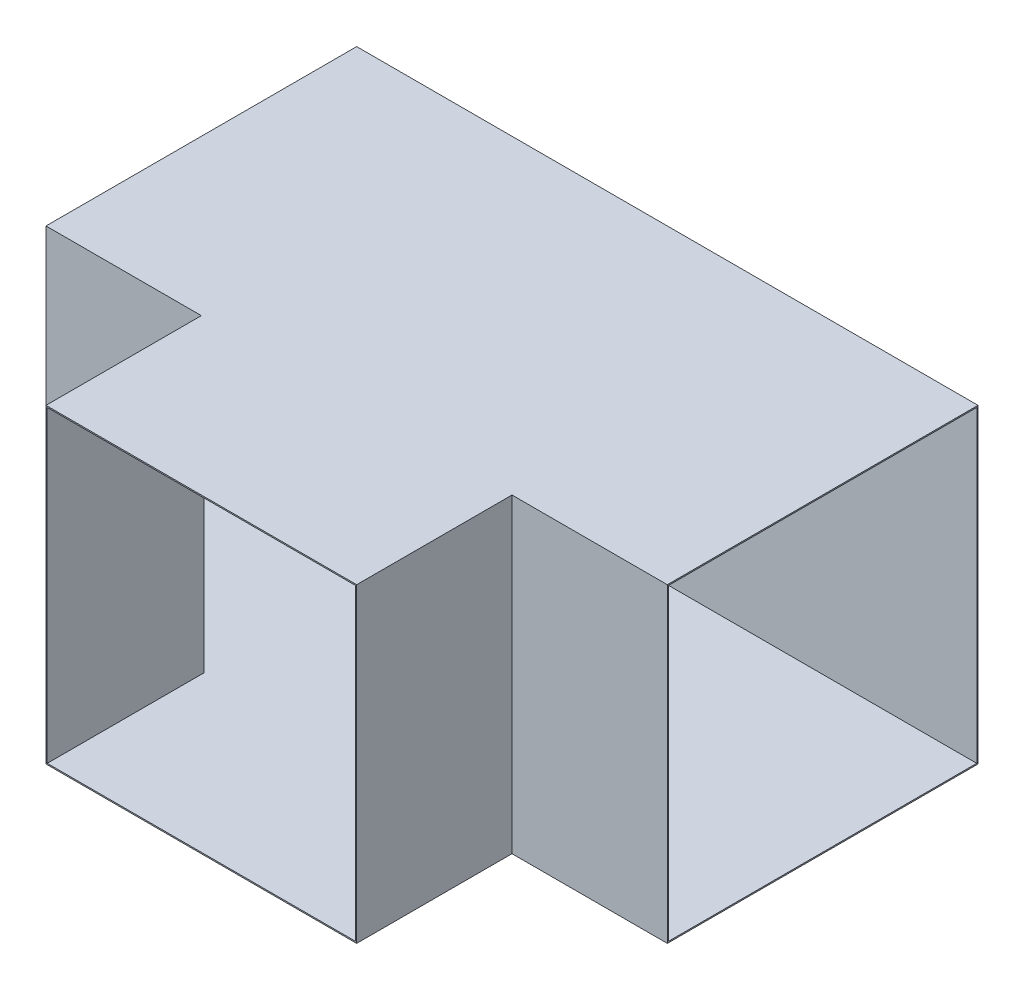
ISO-10303-21;
HEADER;
FILE_DESCRIPTION(('STEP AP214'),'2;1');
FILE_NAME('part.step','',(''),(''),'','','');
FILE_SCHEMA(('AUTOMOTIVE_DESIGN { 1 0 10303 214 1 1 1 1 }'));
ENDSEC;
DATA;
#1=APPLICATION_CONTEXT('core data for automotive mechanical design processes');
#2=APPLICATION_PROTOCOL_DEFINITION('international standard','automotive_design',2000,#1);
#3=PRODUCT_CONTEXT('',#1,'mechanical');
#4=PRODUCT('Part','Part','',(#3));
#5=PRODUCT_RELATED_PRODUCT_CATEGORY('part','',(#4));
#6=PRODUCT_DEFINITION_FORMATION('','',#4);
#7=PRODUCT_DEFINITION_CONTEXT('part definition',#1,'design');
#8=PRODUCT_DEFINITION('design','',#6,#7);
#9=PRODUCT_DEFINITION_SHAPE('','',#8);
#10=(LENGTH_UNIT() NAMED_UNIT(*) SI_UNIT(.MILLI.,.METRE.));
#11=(NAMED_UNIT(*) PLANE_ANGLE_UNIT() SI_UNIT($,.RADIAN.));
#12=(NAMED_UNIT(*) SI_UNIT($,.STERADIAN.) SOLID_ANGLE_UNIT());
#13=UNCERTAINTY_MEASURE_WITH_UNIT(LENGTH_MEASURE(1.E-05),#10,'distance_accuracy_value','');
#14=(GEOMETRIC_REPRESENTATION_CONTEXT(3) GLOBAL_UNCERTAINTY_ASSIGNED_CONTEXT((#13)) GLOBAL_UNIT_ASSIGNED_CONTEXT((#10,
#11,#12)) REPRESENTATION_CONTEXT('',''));
#15=CARTESIAN_POINT('',(0.,0.,0.));
#16=DIRECTION('',(0.,0.,1.));
#17=DIRECTION('',(1.,0.,0.));
#18=AXIS2_PLACEMENT_3D('',#15,#16,#17);
#19=CARTESIAN_POINT('',(500.,250.,248.));
#20=DIRECTION('',(0.,0.,-1.));
#21=DIRECTION('',(0.,1.,0.));
#22=AXIS2_PLACEMENT_3D('',#19,#20,#21);
#23=PLANE('',#22);
#24=DIRECTION('',(-1.,0.,0.));
#25=VECTOR('',#24,1.);
#26=CARTESIAN_POINT('',(500.,-248.,248.));
#27=LINE('',#26,#25);
#28=CARTESIAN_POINT('',(500.,-248.,248.));
#29=VERTEX_POINT('',#28);
#30=CARTESIAN_POINT('',(248.,-248.,248.));
#31=VERTEX_POINT('',#30);
#32=EDGE_CURVE('E221',#29,#31,#27,.T.);
#33=ORIENTED_EDGE('',*,*,#32,.T.);
#34=DIRECTION('',(0.,-1.,0.));
#35=VECTOR('',#34,1.);
#36=CARTESIAN_POINT('',(248.,248.,248.));
#37=LINE('',#36,#35);
#38=CARTESIAN_POINT('',(248.,248.,248.));
#39=VERTEX_POINT('',#38);
#40=EDGE_CURVE('E215',#39,#31,#37,.T.);
#41=ORIENTED_EDGE('',*,*,#40,.F.);
#42=DIRECTION('',(-1.,0.,0.));
#43=VECTOR('',#42,1.);
#44=CARTESIAN_POINT('',(500.,248.,248.));
#45=LINE('',#44,#43);
#46=CARTESIAN_POINT('',(500.,248.,248.));
#47=VERTEX_POINT('',#46);
#48=EDGE_CURVE('E511',#47,#39,#45,.T.);
#49=ORIENTED_EDGE('',*,*,#48,.F.);
#50=DIRECTION('',(0.,-1.,0.));
#51=VECTOR('',#50,1.);
#52=CARTESIAN_POINT('',(500.,250.,248.));
#53=LINE('',#52,#51);
#54=EDGE_CURVE('E523',#47,#29,#53,.T.);
#55=ORIENTED_EDGE('',*,*,#54,.T.);
#56=EDGE_LOOP('',(#33,#41,#49,#55));
#57=FACE_BOUND('',#56,.T.);
#58=ADVANCED_FACE('F80',(#57),#23,.T.);
#59=CARTESIAN_POINT('',(-248.,248.,248.));
#60=VERTEX_POINT('',#59);
#61=CARTESIAN_POINT('',(-500.,248.,248.));
#62=VERTEX_POINT('',#61);
#63=EDGE_CURVE('E214',#60,#62,#45,.T.);
#64=ORIENTED_EDGE('',*,*,#63,.F.);
#65=DIRECTION('',(0.,1.,0.));
#66=VECTOR('',#65,1.);
#67=CARTESIAN_POINT('',(-248.,-248.,248.));
#68=LINE('',#67,#66);
#69=CARTESIAN_POINT('',(-248.,-248.,248.));
#70=VERTEX_POINT('',#69);
#71=EDGE_CURVE('E198',#70,#60,#68,.T.);
#72=ORIENTED_EDGE('',*,*,#71,.F.);
#73=CARTESIAN_POINT('',(-500.,-248.,248.));
#74=VERTEX_POINT('',#73);
#75=EDGE_CURVE('E212',#70,#74,#27,.T.);
#76=ORIENTED_EDGE('',*,*,#75,.T.);
#77=DIRECTION('',(0.,-1.,0.));
#78=VECTOR('',#77,1.);
#79=CARTESIAN_POINT('',(-500.,250.,248.));
#80=LINE('',#79,#78);
#81=EDGE_CURVE('E321',#62,#74,#80,.T.);
#82=ORIENTED_EDGE('',*,*,#81,.F.);
#83=EDGE_LOOP('',(#64,#72,#76,#82));
#84=FACE_BOUND('',#83,.T.);
#85=ADVANCED_FACE('F210',(#84),#23,.T.);
#86=CARTESIAN_POINT('',(500.,250.,250.));
#87=DIRECTION('',(0.,0.,-1.));
#88=DIRECTION('',(0.,1.,0.));
#89=AXIS2_PLACEMENT_3D('',#86,#87,#88);
#90=PLANE('',#89);
#91=DIRECTION('',(-1.,0.,0.));
#92=VECTOR('',#91,1.);
#93=CARTESIAN_POINT('',(500.,-250.,250.));
#94=LINE('',#93,#92);
#95=CARTESIAN_POINT('',(-250.,-250.,250.));
#96=VERTEX_POINT('',#95);
#97=CARTESIAN_POINT('',(-500.,-250.,250.));
#98=VERTEX_POINT('',#97);
#99=EDGE_CURVE('E89',#96,#98,#94,.T.);
#100=ORIENTED_EDGE('',*,*,#99,.F.);
#101=DIRECTION('',(0.,1.,0.));
#102=VECTOR('',#101,1.);
#103=CARTESIAN_POINT('',(-250.,-250.,250.));
#104=LINE('',#103,#102);
#105=CARTESIAN_POINT('',(-250.,250.,250.));
#106=VERTEX_POINT('',#105);
#107=EDGE_CURVE('E206',#96,#106,#104,.T.);
#108=ORIENTED_EDGE('',*,*,#107,.T.);
#109=DIRECTION('',(-1.,0.,0.));
#110=VECTOR('',#109,1.);
#111=CARTESIAN_POINT('',(500.,250.,250.));
#112=LINE('',#111,#110);
#113=CARTESIAN_POINT('',(-500.,250.,250.));
#114=VERTEX_POINT('',#113);
#115=EDGE_CURVE('E240',#106,#114,#112,.T.);
#116=ORIENTED_EDGE('',*,*,#115,.T.);
#117=DIRECTION('',(0.,-1.,0.));
#118=VECTOR('',#117,1.);
#119=CARTESIAN_POINT('',(-500.,250.,250.));
#120=LINE('',#119,#118);
#121=EDGE_CURVE('E225',#114,#98,#120,.T.);
#122=ORIENTED_EDGE('',*,*,#121,.T.);
#123=EDGE_LOOP('',(#100,#108,#116,#122));
#124=FACE_BOUND('',#123,.T.);
#125=ADVANCED_FACE('F284',(#124),#90,.F.);
#126=CARTESIAN_POINT('',(500.,0.,0.));
#127=DIRECTION('',(1.,0.,0.));
#128=DIRECTION('',(0.,0.,-1.));
#129=AXIS2_PLACEMENT_3D('',#126,#127,#128);
#130=PLANE('',#129);
#131=DIRECTION('',(0.,-1.,0.));
#132=VECTOR('',#131,1.);
#133=CARTESIAN_POINT('',(500.,250.,250.));
#134=LINE('',#133,#132);
#135=CARTESIAN_POINT('',(500.,250.,250.));
#136=VERTEX_POINT('',#135);
#137=CARTESIAN_POINT('',(500.,-250.,250.));
#138=VERTEX_POINT('',#137);
#139=EDGE_CURVE('E230',#136,#138,#134,.T.);
#140=ORIENTED_EDGE('',*,*,#139,.T.);
#141=DIRECTION('',(0.,0.,-1.));
#142=VECTOR('',#141,1.);
#143=CARTESIAN_POINT('',(500.,-250.,250.));
#144=LINE('',#143,#142);
#145=CARTESIAN_POINT('',(500.,-250.,-250.));
#146=VERTEX_POINT('',#145);
#147=EDGE_CURVE('E233',#138,#146,#144,.T.);
#148=ORIENTED_EDGE('',*,*,#147,.T.);
#149=DIRECTION('',(0.,1.,0.));
#150=VECTOR('',#149,1.);
#151=CARTESIAN_POINT('',(500.,250.,-250.));
#152=LINE('',#151,#150);
#153=CARTESIAN_POINT('',(500.,250.,-250.));
#154=VERTEX_POINT('',#153);
#155=EDGE_CURVE('E236',#146,#154,#152,.T.);
#156=ORIENTED_EDGE('',*,*,#155,.T.);
#157=DIRECTION('',(0.,0.,1.));
#158=VECTOR('',#157,1.);
#159=CARTESIAN_POINT('',(500.,250.,250.));
#160=LINE('',#159,#158);
#161=EDGE_CURVE('E238',#154,#136,#160,.T.);
#162=ORIENTED_EDGE('',*,*,#161,.T.);
#163=EDGE_LOOP('',(#140,#148,#156,#162));
#164=FACE_BOUND('',#163,.T.);
#165=DIRECTION('',(0.,0.,-1.));
#166=VECTOR('',#165,1.);
#167=CARTESIAN_POINT('',(500.,-248.,250.));
#168=LINE('',#167,#166);
#169=CARTESIAN_POINT('',(500.,-248.,-248.));
#170=VERTEX_POINT('',#169);
#171=EDGE_CURVE('E532',#29,#170,#168,.T.);
#172=ORIENTED_EDGE('',*,*,#171,.F.);
#173=ORIENTED_EDGE('',*,*,#54,.F.);
#174=DIRECTION('',(0.,0.,1.));
#175=VECTOR('',#174,1.);
#176=CARTESIAN_POINT('',(500.,248.,250.));
#177=LINE('',#176,#175);
#178=CARTESIAN_POINT('',(500.,248.,-248.));
#179=VERTEX_POINT('',#178);
#180=EDGE_CURVE('E517',#179,#47,#177,.T.);
#181=ORIENTED_EDGE('',*,*,#180,.F.);
#182=DIRECTION('',(0.,1.,0.));
#183=VECTOR('',#182,1.);
#184=CARTESIAN_POINT('',(500.,250.,-248.));
#185=LINE('',#184,#183);
#186=EDGE_CURVE('E529',#170,#179,#185,.T.);
#187=ORIENTED_EDGE('',*,*,#186,.F.);
#188=EDGE_LOOP('',(#172,#173,#181,#187));
#189=FACE_BOUND('',#188,.T.);
#190=ADVANCED_FACE('F335',(#164,#189),#130,.T.);
#191=CARTESIAN_POINT('',(-500.,0.,0.));
#192=DIRECTION('',(1.,0.,0.));
#193=DIRECTION('',(0.,0.,-1.));
#194=AXIS2_PLACEMENT_3D('',#191,#192,#193);
#195=PLANE('',#194);
#196=ORIENTED_EDGE('',*,*,#121,.F.);
#197=DIRECTION('',(0.,0.,1.));
#198=VECTOR('',#197,1.);
#199=CARTESIAN_POINT('',(-500.,250.,250.));
#200=LINE('',#199,#198);
#201=CARTESIAN_POINT('',(-500.,250.,-250.));
#202=VERTEX_POINT('',#201);
#203=EDGE_CURVE('E234',#202,#114,#200,.T.);
#204=ORIENTED_EDGE('',*,*,#203,.F.);
#205=DIRECTION('',(0.,1.,0.));
#206=VECTOR('',#205,1.);
#207=CARTESIAN_POINT('',(-500.,250.,-250.));
#208=LINE('',#207,#206);
#209=CARTESIAN_POINT('',(-500.,-250.,-250.));
#210=VERTEX_POINT('',#209);
#211=EDGE_CURVE('E245',#210,#202,#208,.T.);
#212=ORIENTED_EDGE('',*,*,#211,.F.);
#213=DIRECTION('',(0.,0.,-1.));
#214=VECTOR('',#213,1.);
#215=CARTESIAN_POINT('',(-500.,-250.,250.));
#216=LINE('',#215,#214);
#217=EDGE_CURVE('E243',#98,#210,#216,.T.);
#218=ORIENTED_EDGE('',*,*,#217,.F.);
#219=EDGE_LOOP('',(#196,#204,#212,#218));
#220=FACE_BOUND('',#219,.T.);
#221=ORIENTED_EDGE('',*,*,#81,.T.);
#222=DIRECTION('',(0.,0.,-1.));
#223=VECTOR('',#222,1.);
#224=CARTESIAN_POINT('',(-500.,-248.,250.));
#225=LINE('',#224,#223);
#226=CARTESIAN_POINT('',(-500.,-248.,-248.));
#227=VERTEX_POINT('',#226);
#228=EDGE_CURVE('E219',#74,#227,#225,.T.);
#229=ORIENTED_EDGE('',*,*,#228,.T.);
#230=DIRECTION('',(0.,1.,0.));
#231=VECTOR('',#230,1.);
#232=CARTESIAN_POINT('',(-500.,250.,-248.));
#233=LINE('',#232,#231);
#234=CARTESIAN_POINT('',(-500.,248.,-248.));
#235=VERTEX_POINT('',#234);
#236=EDGE_CURVE('E524',#227,#235,#233,.T.);
#237=ORIENTED_EDGE('',*,*,#236,.T.);
#238=DIRECTION('',(0.,0.,1.));
#239=VECTOR('',#238,1.);
#240=CARTESIAN_POINT('',(-500.,248.,250.));
#241=LINE('',#240,#239);
#242=EDGE_CURVE('E520',#235,#62,#241,.T.);
#243=ORIENTED_EDGE('',*,*,#242,.T.);
#244=EDGE_LOOP('',(#221,#229,#237,#243));
#245=FACE_BOUND('',#244,.T.);
#246=ADVANCED_FACE('F279',(#220,#245),#195,.F.);
#247=CARTESIAN_POINT('',(250.,250.,250.));
#248=VERTEX_POINT('',#247);
#249=EDGE_CURVE('E257',#136,#248,#112,.T.);
#250=ORIENTED_EDGE('',*,*,#249,.T.);
#251=DIRECTION('',(0.,-1.,0.));
#252=VECTOR('',#251,1.);
#253=CARTESIAN_POINT('',(250.,-250.,250.));
#254=LINE('',#253,#252);
#255=CARTESIAN_POINT('',(250.,-250.,250.));
#256=VERTEX_POINT('',#255);
#257=EDGE_CURVE('E307',#248,#256,#254,.T.);
#258=ORIENTED_EDGE('',*,*,#257,.T.);
#259=EDGE_CURVE('E12',#138,#256,#94,.T.);
#260=ORIENTED_EDGE('',*,*,#259,.F.);
#261=ORIENTED_EDGE('',*,*,#139,.F.);
#262=EDGE_LOOP('',(#250,#258,#260,#261));
#263=FACE_BOUND('',#262,.T.);
#264=ADVANCED_FACE('F82',(#263),#90,.F.);
#265=CARTESIAN_POINT('',(500.,-250.,250.));
#266=DIRECTION('',(0.,1.,0.));
#267=DIRECTION('',(0.,0.,1.));
#268=AXIS2_PLACEMENT_3D('',#265,#266,#267);
#269=PLANE('',#268);
#270=ORIENTED_EDGE('',*,*,#217,.T.);
#271=DIRECTION('',(-1.,0.,0.));
#272=VECTOR('',#271,1.);
#273=CARTESIAN_POINT('',(500.,-250.,-250.));
#274=LINE('',#273,#272);
#275=EDGE_CURVE('E261',#146,#210,#274,.T.);
#276=ORIENTED_EDGE('',*,*,#275,.F.);
#277=ORIENTED_EDGE('',*,*,#147,.F.);
#278=ORIENTED_EDGE('',*,*,#259,.T.);
#279=DIRECTION('',(0.,0.,-1.));
#280=VECTOR('',#279,1.);
#281=CARTESIAN_POINT('',(250.,-250.,500.));
#282=LINE('',#281,#280);
#283=CARTESIAN_POINT('',(250.,-250.,500.));
#284=VERTEX_POINT('',#283);
#285=EDGE_CURVE('E105',#284,#256,#282,.T.);
#286=ORIENTED_EDGE('',*,*,#285,.F.);
#287=DIRECTION('',(-1.,0.,0.));
#288=VECTOR('',#287,1.);
#289=CARTESIAN_POINT('',(-250.,-250.,500.));
#290=LINE('',#289,#288);
#291=CARTESIAN_POINT('',(-250.,-250.,500.));
#292=VERTEX_POINT('',#291);
#293=EDGE_CURVE('E294',#284,#292,#290,.T.);
#294=ORIENTED_EDGE('',*,*,#293,.T.);
#295=DIRECTION('',(0.,0.,-1.));
#296=VECTOR('',#295,1.);
#297=CARTESIAN_POINT('',(-250.,-250.,500.));
#298=LINE('',#297,#296);
#299=EDGE_CURVE('E306',#292,#96,#298,.T.);
#300=ORIENTED_EDGE('',*,*,#299,.T.);
#301=ORIENTED_EDGE('',*,*,#99,.T.);
#302=EDGE_LOOP('',(#270,#276,#277,#278,#286,#294,#300,#301));
#303=FACE_BOUND('',#302,.T.);
#304=ADVANCED_FACE('F339',(#303),#269,.F.);
#305=CARTESIAN_POINT('',(500.,250.,-250.));
#306=DIRECTION('',(0.,0.,1.));
#307=DIRECTION('',(0.,-1.,0.));
#308=AXIS2_PLACEMENT_3D('',#305,#306,#307);
#309=PLANE('',#308);
#310=ORIENTED_EDGE('',*,*,#211,.T.);
#311=DIRECTION('',(-1.,0.,0.));
#312=VECTOR('',#311,1.);
#313=CARTESIAN_POINT('',(500.,250.,-250.));
#314=LINE('',#313,#312);
#315=EDGE_CURVE('E251',#154,#202,#314,.T.);
#316=ORIENTED_EDGE('',*,*,#315,.F.);
#317=ORIENTED_EDGE('',*,*,#155,.F.);
#318=ORIENTED_EDGE('',*,*,#275,.T.);
#319=EDGE_LOOP('',(#310,#316,#317,#318));
#320=FACE_BOUND('',#319,.T.);
#321=ADVANCED_FACE('F337',(#320),#309,.F.);
#322=CARTESIAN_POINT('',(500.,250.,250.));
#323=DIRECTION('',(0.,-1.,0.));
#324=DIRECTION('',(0.,0.,-1.));
#325=AXIS2_PLACEMENT_3D('',#322,#323,#324);
#326=PLANE('',#325);
#327=ORIENTED_EDGE('',*,*,#203,.T.);
#328=ORIENTED_EDGE('',*,*,#115,.F.);
#329=DIRECTION('',(0.,0.,-1.));
#330=VECTOR('',#329,1.);
#331=CARTESIAN_POINT('',(-250.,250.,500.));
#332=LINE('',#331,#330);
#333=CARTESIAN_POINT('',(-250.,250.,500.));
#334=VERTEX_POINT('',#333);
#335=EDGE_CURVE('E288',#334,#106,#332,.T.);
#336=ORIENTED_EDGE('',*,*,#335,.F.);
#337=DIRECTION('',(1.,0.,0.));
#338=VECTOR('',#337,1.);
#339=CARTESIAN_POINT('',(-250.,250.,500.));
#340=LINE('',#339,#338);
#341=CARTESIAN_POINT('',(250.,250.,500.));
#342=VERTEX_POINT('',#341);
#343=EDGE_CURVE('E290',#334,#342,#340,.T.);
#344=ORIENTED_EDGE('',*,*,#343,.T.);
#345=DIRECTION('',(0.,0.,-1.));
#346=VECTOR('',#345,1.);
#347=CARTESIAN_POINT('',(250.,250.,500.));
#348=LINE('',#347,#346);
#349=EDGE_CURVE('E293',#342,#248,#348,.T.);
#350=ORIENTED_EDGE('',*,*,#349,.T.);
#351=ORIENTED_EDGE('',*,*,#249,.F.);
#352=ORIENTED_EDGE('',*,*,#161,.F.);
#353=ORIENTED_EDGE('',*,*,#315,.T.);
#354=EDGE_LOOP('',(#327,#328,#336,#344,#350,#351,#352,#353));
#355=FACE_BOUND('',#354,.T.);
#356=ADVANCED_FACE('F274',(#355),#326,.F.);
#357=CARTESIAN_POINT('',(500.,-248.,250.));
#358=DIRECTION('',(0.,1.,0.));
#359=DIRECTION('',(0.,0.,1.));
#360=AXIS2_PLACEMENT_3D('',#357,#358,#359);
#361=PLANE('',#360);
#362=ORIENTED_EDGE('',*,*,#228,.F.);
#363=ORIENTED_EDGE('',*,*,#75,.F.);
#364=DIRECTION('',(0.,0.,-1.));
#365=VECTOR('',#364,1.);
#366=CARTESIAN_POINT('',(-248.,-248.,500.));
#367=LINE('',#366,#365);
#368=CARTESIAN_POINT('',(-248.,-248.,500.));
#369=VERTEX_POINT('',#368);
#370=EDGE_CURVE('E195',#369,#70,#367,.T.);
#371=ORIENTED_EDGE('',*,*,#370,.F.);
#372=DIRECTION('',(-1.,0.,0.));
#373=VECTOR('',#372,1.);
#374=CARTESIAN_POINT('',(-250.,-248.,500.));
#375=LINE('',#374,#373);
#376=CARTESIAN_POINT('',(248.,-248.,500.));
#377=VERTEX_POINT('',#376);
#378=EDGE_CURVE('E537',#377,#369,#375,.T.);
#379=ORIENTED_EDGE('',*,*,#378,.F.);
#380=DIRECTION('',(0.,0.,-1.));
#381=VECTOR('',#380,1.);
#382=CARTESIAN_POINT('',(248.,-248.,500.));
#383=LINE('',#382,#381);
#384=EDGE_CURVE('E207',#377,#31,#383,.T.);
#385=ORIENTED_EDGE('',*,*,#384,.T.);
#386=ORIENTED_EDGE('',*,*,#32,.F.);
#387=ORIENTED_EDGE('',*,*,#171,.T.);
#388=DIRECTION('',(-1.,0.,0.));
#389=VECTOR('',#388,1.);
#390=CARTESIAN_POINT('',(500.,-248.,-248.));
#391=LINE('',#390,#389);
#392=EDGE_CURVE('E222',#170,#227,#391,.T.);
#393=ORIENTED_EDGE('',*,*,#392,.T.);
#394=EDGE_LOOP('',(#362,#363,#371,#379,#385,#386,#387,#393));
#395=FACE_BOUND('',#394,.T.);
#396=ADVANCED_FACE('F217',(#395),#361,.T.);
#397=CARTESIAN_POINT('',(500.,250.,-248.));
#398=DIRECTION('',(0.,0.,1.));
#399=DIRECTION('',(0.,-1.,0.));
#400=AXIS2_PLACEMENT_3D('',#397,#398,#399);
#401=PLANE('',#400);
#402=ORIENTED_EDGE('',*,*,#236,.F.);
#403=ORIENTED_EDGE('',*,*,#392,.F.);
#404=ORIENTED_EDGE('',*,*,#186,.T.);
#405=DIRECTION('',(-1.,0.,0.));
#406=VECTOR('',#405,1.);
#407=CARTESIAN_POINT('',(500.,248.,-248.));
#408=LINE('',#407,#406);
#409=EDGE_CURVE('E226',#179,#235,#408,.T.);
#410=ORIENTED_EDGE('',*,*,#409,.T.);
#411=EDGE_LOOP('',(#402,#403,#404,#410));
#412=FACE_BOUND('',#411,.T.);
#413=ADVANCED_FACE('F388',(#412),#401,.T.);
#414=CARTESIAN_POINT('',(500.,248.,250.));
#415=DIRECTION('',(0.,-1.,0.));
#416=DIRECTION('',(0.,0.,-1.));
#417=AXIS2_PLACEMENT_3D('',#414,#415,#416);
#418=PLANE('',#417);
#419=ORIENTED_EDGE('',*,*,#242,.F.);
#420=ORIENTED_EDGE('',*,*,#409,.F.);
#421=ORIENTED_EDGE('',*,*,#180,.T.);
#422=ORIENTED_EDGE('',*,*,#48,.T.);
#423=DIRECTION('',(0.,0.,-1.));
#424=VECTOR('',#423,1.);
#425=CARTESIAN_POINT('',(248.,248.,500.));
#426=LINE('',#425,#424);
#427=CARTESIAN_POINT('',(248.,248.,500.));
#428=VERTEX_POINT('',#427);
#429=EDGE_CURVE('E504',#428,#39,#426,.T.);
#430=ORIENTED_EDGE('',*,*,#429,.F.);
#431=DIRECTION('',(1.,0.,0.));
#432=VECTOR('',#431,1.);
#433=CARTESIAN_POINT('',(-250.,248.,500.));
#434=LINE('',#433,#432);
#435=CARTESIAN_POINT('',(-248.,248.,500.));
#436=VERTEX_POINT('',#435);
#437=EDGE_CURVE('E542',#436,#428,#434,.T.);
#438=ORIENTED_EDGE('',*,*,#437,.F.);
#439=DIRECTION('',(0.,0.,-1.));
#440=VECTOR('',#439,1.);
#441=CARTESIAN_POINT('',(-248.,248.,500.));
#442=LINE('',#441,#440);
#443=EDGE_CURVE('E97',#436,#60,#442,.T.);
#444=ORIENTED_EDGE('',*,*,#443,.T.);
#445=ORIENTED_EDGE('',*,*,#63,.T.);
#446=EDGE_LOOP('',(#419,#420,#421,#422,#430,#438,#444,#445));
#447=FACE_BOUND('',#446,.T.);
#448=ADVANCED_FACE('F392',(#447),#418,.T.);
#449=CARTESIAN_POINT('',(-250.,-250.,500.));
#450=DIRECTION('',(-1.,0.,0.));
#451=DIRECTION('',(0.,-1.,0.));
#452=AXIS2_PLACEMENT_3D('',#449,#450,#451);
#453=PLANE('',#452);
#454=ORIENTED_EDGE('',*,*,#107,.F.);
#455=ORIENTED_EDGE('',*,*,#299,.F.);
#456=DIRECTION('',(0.,1.,0.));
#457=VECTOR('',#456,1.);
#458=CARTESIAN_POINT('',(-250.,-250.,500.));
#459=LINE('',#458,#457);
#460=EDGE_CURVE('E301',#292,#334,#459,.T.);
#461=ORIENTED_EDGE('',*,*,#460,.T.);
#462=ORIENTED_EDGE('',*,*,#335,.T.);
#463=EDGE_LOOP('',(#454,#455,#461,#462));
#464=FACE_BOUND('',#463,.T.);
#465=ADVANCED_FACE('F305',(#464),#453,.T.);
#466=CARTESIAN_POINT('',(250.,-250.,500.));
#467=DIRECTION('',(1.,0.,0.));
#468=DIRECTION('',(0.,1.,0.));
#469=AXIS2_PLACEMENT_3D('',#466,#467,#468);
#470=PLANE('',#469);
#471=ORIENTED_EDGE('',*,*,#257,.F.);
#472=ORIENTED_EDGE('',*,*,#349,.F.);
#473=DIRECTION('',(0.,-1.,0.));
#474=VECTOR('',#473,1.);
#475=CARTESIAN_POINT('',(250.,-250.,500.));
#476=LINE('',#475,#474);
#477=EDGE_CURVE('E303',#342,#284,#476,.T.);
#478=ORIENTED_EDGE('',*,*,#477,.T.);
#479=ORIENTED_EDGE('',*,*,#285,.T.);
#480=EDGE_LOOP('',(#471,#472,#478,#479));
#481=FACE_BOUND('',#480,.T.);
#482=ADVANCED_FACE('F331',(#481),#470,.T.);
#483=CARTESIAN_POINT('',(0.,0.,500.));
#484=DIRECTION('',(0.,0.,-1.));
#485=DIRECTION('',(-1.,0.,0.));
#486=AXIS2_PLACEMENT_3D('',#483,#484,#485);
#487=PLANE('',#486);
#488=ORIENTED_EDGE('',*,*,#378,.T.);
#489=DIRECTION('',(0.,1.,0.));
#490=VECTOR('',#489,1.);
#491=CARTESIAN_POINT('',(-248.,-250.,500.));
#492=LINE('',#491,#490);
#493=EDGE_CURVE('E201',#369,#436,#492,.T.);
#494=ORIENTED_EDGE('',*,*,#493,.T.);
#495=ORIENTED_EDGE('',*,*,#437,.T.);
#496=DIRECTION('',(0.,-1.,0.));
#497=VECTOR('',#496,1.);
#498=CARTESIAN_POINT('',(248.,-250.,500.));
#499=LINE('',#498,#497);
#500=EDGE_CURVE('E507',#428,#377,#499,.T.);
#501=ORIENTED_EDGE('',*,*,#500,.T.);
#502=EDGE_LOOP('',(#488,#494,#495,#501));
#503=FACE_BOUND('',#502,.T.);
#504=ORIENTED_EDGE('',*,*,#460,.F.);
#505=ORIENTED_EDGE('',*,*,#293,.F.);
#506=ORIENTED_EDGE('',*,*,#477,.F.);
#507=ORIENTED_EDGE('',*,*,#343,.F.);
#508=EDGE_LOOP('',(#504,#505,#506,#507));
#509=FACE_BOUND('',#508,.T.);
#510=ADVANCED_FACE('F299',(#503,#509),#487,.F.);
#511=CARTESIAN_POINT('',(-248.,-250.,500.));
#512=DIRECTION('',(-1.,0.,0.));
#513=DIRECTION('',(0.,-1.,0.));
#514=AXIS2_PLACEMENT_3D('',#511,#512,#513);
#515=PLANE('',#514);
#516=ORIENTED_EDGE('',*,*,#370,.T.);
#517=ORIENTED_EDGE('',*,*,#71,.T.);
#518=ORIENTED_EDGE('',*,*,#443,.F.);
#519=ORIENTED_EDGE('',*,*,#493,.F.);
#520=EDGE_LOOP('',(#516,#517,#518,#519));
#521=FACE_BOUND('',#520,.T.);
#522=ADVANCED_FACE('F197',(#521),#515,.F.);
#523=CARTESIAN_POINT('',(248.,-250.,500.));
#524=DIRECTION('',(1.,0.,0.));
#525=DIRECTION('',(0.,1.,0.));
#526=AXIS2_PLACEMENT_3D('',#523,#524,#525);
#527=PLANE('',#526);
#528=ORIENTED_EDGE('',*,*,#429,.T.);
#529=ORIENTED_EDGE('',*,*,#40,.T.);
#530=ORIENTED_EDGE('',*,*,#384,.F.);
#531=ORIENTED_EDGE('',*,*,#500,.F.);
#532=EDGE_LOOP('',(#528,#529,#530,#531));
#533=FACE_BOUND('',#532,.T.);
#534=ADVANCED_FACE('F432',(#533),#527,.F.);
#535=CLOSED_SHELL('',(#58,#85,#125,#190,#246,#264,#304,#321,#356,#396,#413,#448,#465,#482,#510,
#522,#534));
#536=MANIFOLD_SOLID_BREP('B2',#535);
#537=ADVANCED_BREP_SHAPE_REPRESENTATION('',(#18,#536),#14);
#538=SHAPE_DEFINITION_REPRESENTATION(#9,#537);
ENDSEC;
END-ISO-10303-21;
